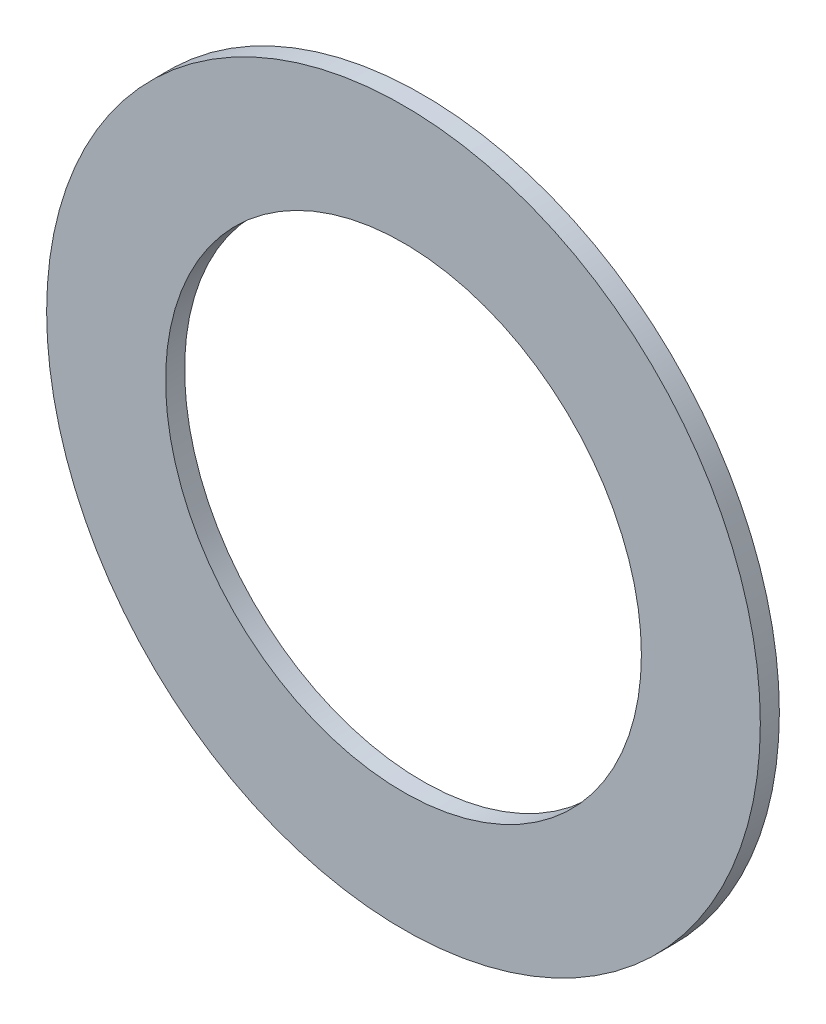
ISO-10303-21;
HEADER;
FILE_DESCRIPTION(('STEP AP214'),'2;1');
FILE_NAME('part.step','',(''),(''),'','','');
FILE_SCHEMA(('AUTOMOTIVE_DESIGN { 1 0 10303 214 1 1 1 1 }'));
ENDSEC;
DATA;
#1=APPLICATION_CONTEXT('core data for automotive mechanical design processes');
#2=APPLICATION_PROTOCOL_DEFINITION('international standard','automotive_design',2000,#1);
#3=PRODUCT_CONTEXT('',#1,'mechanical');
#4=PRODUCT('Part','Part','',(#3));
#5=PRODUCT_RELATED_PRODUCT_CATEGORY('part','',(#4));
#6=PRODUCT_DEFINITION_FORMATION('','',#4);
#7=PRODUCT_DEFINITION_CONTEXT('part definition',#1,'design');
#8=PRODUCT_DEFINITION('design','',#6,#7);
#9=PRODUCT_DEFINITION_SHAPE('','',#8);
#10=(LENGTH_UNIT() NAMED_UNIT(*) SI_UNIT(.MILLI.,.METRE.));
#11=(NAMED_UNIT(*) PLANE_ANGLE_UNIT() SI_UNIT($,.RADIAN.));
#12=(NAMED_UNIT(*) SI_UNIT($,.STERADIAN.) SOLID_ANGLE_UNIT());
#13=UNCERTAINTY_MEASURE_WITH_UNIT(LENGTH_MEASURE(1.E-05),#10,'distance_accuracy_value','');
#14=(GEOMETRIC_REPRESENTATION_CONTEXT(3) GLOBAL_UNCERTAINTY_ASSIGNED_CONTEXT((#13)) GLOBAL_UNIT_ASSIGNED_CONTEXT((#10,
#11,#12)) REPRESENTATION_CONTEXT('',''));
#15=CARTESIAN_POINT('',(0.,0.,0.));
#16=DIRECTION('',(0.,0.,1.));
#17=DIRECTION('',(1.,0.,0.));
#18=AXIS2_PLACEMENT_3D('',#15,#16,#17);
#19=CARTESIAN_POINT('',(0.,0.,0.254));
#20=DIRECTION('',(0.,0.,1.));
#21=DIRECTION('',(1.,0.,0.));
#22=AXIS2_PLACEMENT_3D('',#19,#20,#21);
#23=PLANE('',#22);
#24=CARTESIAN_POINT('',(0.,0.,0.254));
#25=DIRECTION('',(0.,0.,1.));
#26=DIRECTION('',(1.,0.,0.));
#27=AXIS2_PLACEMENT_3D('',#24,#25,#26);
#28=CIRCLE('',#27,4.7625);
#29=CARTESIAN_POINT('',(4.7625,0.,0.254));
#30=VERTEX_POINT('',#29);
#31=EDGE_CURVE('E10',#30,#30,#28,.T.);
#32=ORIENTED_EDGE('',*,*,#31,.T.);
#33=EDGE_LOOP('',(#32));
#34=FACE_BOUND('',#33,.T.);
#35=CARTESIAN_POINT('',(0.,0.,0.254));
#36=DIRECTION('',(0.,0.,1.));
#37=DIRECTION('',(1.,0.,0.));
#38=AXIS2_PLACEMENT_3D('',#35,#36,#37);
#39=CIRCLE('',#38,3.175);
#40=CARTESIAN_POINT('',(3.175,0.,0.254));
#41=VERTEX_POINT('',#40);
#42=EDGE_CURVE('E43',#41,#41,#39,.T.);
#43=ORIENTED_EDGE('',*,*,#42,.F.);
#44=EDGE_LOOP('',(#43));
#45=FACE_BOUND('',#44,.T.);
#46=ADVANCED_FACE('F32',(#34,#45),#23,.T.);
#47=CARTESIAN_POINT('',(0.,0.,0.));
#48=DIRECTION('',(0.,0.,1.));
#49=DIRECTION('',(1.,0.,0.));
#50=AXIS2_PLACEMENT_3D('',#47,#48,#49);
#51=PLANE('',#50);
#52=CARTESIAN_POINT('',(0.,0.,0.));
#53=DIRECTION('',(0.,0.,1.));
#54=DIRECTION('',(1.,0.,0.));
#55=AXIS2_PLACEMENT_3D('',#52,#53,#54);
#56=CIRCLE('',#55,4.7625);
#57=CARTESIAN_POINT('',(4.7625,0.,0.));
#58=VERTEX_POINT('',#57);
#59=EDGE_CURVE('E36',#58,#58,#56,.T.);
#60=ORIENTED_EDGE('',*,*,#59,.F.);
#61=EDGE_LOOP('',(#60));
#62=FACE_BOUND('',#61,.T.);
#63=CARTESIAN_POINT('',(0.,0.,0.));
#64=DIRECTION('',(0.,0.,1.));
#65=DIRECTION('',(1.,0.,0.));
#66=AXIS2_PLACEMENT_3D('',#63,#64,#65);
#67=CIRCLE('',#66,3.175);
#68=CARTESIAN_POINT('',(3.175,0.,0.));
#69=VERTEX_POINT('',#68);
#70=EDGE_CURVE('E45',#69,#69,#67,.T.);
#71=ORIENTED_EDGE('',*,*,#70,.T.);
#72=EDGE_LOOP('',(#71));
#73=FACE_BOUND('',#72,.T.);
#74=ADVANCED_FACE('F55',(#62,#73),#51,.F.);
#75=CARTESIAN_POINT('',(0.,0.,0.254));
#76=DIRECTION('',(0.,0.,-1.));
#77=DIRECTION('',(-1.,0.,0.));
#78=AXIS2_PLACEMENT_3D('',#75,#76,#77);
#79=CYLINDRICAL_SURFACE('',#78,4.7625);
#80=ORIENTED_EDGE('',*,*,#31,.F.);
#81=EDGE_LOOP('',(#80));
#82=FACE_BOUND('',#81,.T.);
#83=ORIENTED_EDGE('',*,*,#59,.T.);
#84=EDGE_LOOP('',(#83));
#85=FACE_BOUND('',#84,.T.);
#86=ADVANCED_FACE('F34',(#82,#85),#79,.T.);
#87=CARTESIAN_POINT('',(0.,0.,0.254));
#88=DIRECTION('',(0.,0.,-1.));
#89=DIRECTION('',(-1.,0.,0.));
#90=AXIS2_PLACEMENT_3D('',#87,#88,#89);
#91=CYLINDRICAL_SURFACE('',#90,3.175);
#92=ORIENTED_EDGE('',*,*,#42,.T.);
#93=EDGE_LOOP('',(#92));
#94=FACE_BOUND('',#93,.T.);
#95=ORIENTED_EDGE('',*,*,#70,.F.);
#96=EDGE_LOOP('',(#95));
#97=FACE_BOUND('',#96,.T.);
#98=ADVANCED_FACE('F51',(#94,#97),#91,.F.);
#99=CLOSED_SHELL('',(#46,#74,#86,#98));
#100=MANIFOLD_SOLID_BREP('B2',#99);
#101=ADVANCED_BREP_SHAPE_REPRESENTATION('',(#18,#100),#14);
#102=SHAPE_DEFINITION_REPRESENTATION(#9,#101);
ENDSEC;
END-ISO-10303-21;
